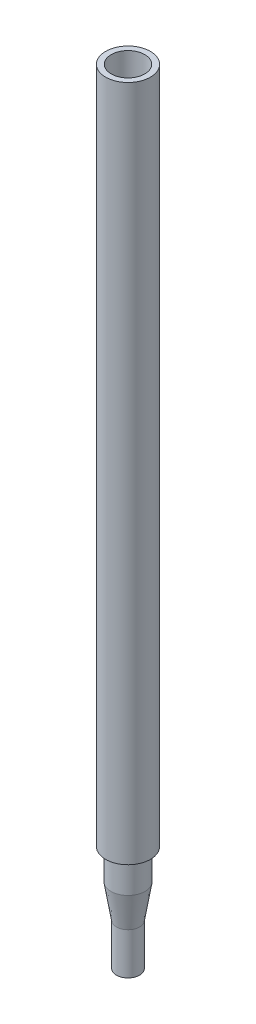
ISO-10303-21;
HEADER;
FILE_DESCRIPTION(('STEP AP214'),'2;1');
FILE_NAME('part.step','',(''),(''),'','','');
FILE_SCHEMA(('AUTOMOTIVE_DESIGN { 1 0 10303 214 1 1 1 1 }'));
ENDSEC;
DATA;
#1=APPLICATION_CONTEXT('core data for automotive mechanical design processes');
#2=APPLICATION_PROTOCOL_DEFINITION('international standard','automotive_design',2000,#1);
#3=PRODUCT_CONTEXT('',#1,'mechanical');
#4=PRODUCT('Part','Part','',(#3));
#5=PRODUCT_RELATED_PRODUCT_CATEGORY('part','',(#4));
#6=PRODUCT_DEFINITION_FORMATION('','',#4);
#7=PRODUCT_DEFINITION_CONTEXT('part definition',#1,'design');
#8=PRODUCT_DEFINITION('design','',#6,#7);
#9=PRODUCT_DEFINITION_SHAPE('','',#8);
#10=(LENGTH_UNIT() NAMED_UNIT(*) SI_UNIT(.MILLI.,.METRE.));
#11=(NAMED_UNIT(*) PLANE_ANGLE_UNIT() SI_UNIT($,.RADIAN.));
#12=(NAMED_UNIT(*) SI_UNIT($,.STERADIAN.) SOLID_ANGLE_UNIT());
#13=UNCERTAINTY_MEASURE_WITH_UNIT(LENGTH_MEASURE(1.E-05),#10,'distance_accuracy_value','');
#14=(GEOMETRIC_REPRESENTATION_CONTEXT(3) GLOBAL_UNCERTAINTY_ASSIGNED_CONTEXT((#13)) GLOBAL_UNIT_ASSIGNED_CONTEXT((#10,
#11,#12)) REPRESENTATION_CONTEXT('',''));
#15=CARTESIAN_POINT('',(0.,0.,0.));
#16=DIRECTION('',(0.,0.,1.));
#17=DIRECTION('',(1.,0.,0.));
#18=AXIS2_PLACEMENT_3D('',#15,#16,#17);
#19=CARTESIAN_POINT('',(0.,0.,1.555));
#20=DIRECTION('',(0.,1.,0.));
#21=DIRECTION('',(0.,0.,1.));
#22=AXIS2_PLACEMENT_3D('',#19,#20,#21);
#23=PLANE('',#22);
#24=CARTESIAN_POINT('',(0.,0.,0.));
#25=DIRECTION('',(0.,-1.,0.));
#26=DIRECTION('',(0.,0.,-1.));
#27=AXIS2_PLACEMENT_3D('',#24,#25,#26);
#28=CIRCLE('',#27,0.805);
#29=CARTESIAN_POINT('',(0.,0.,-0.805000000000003));
#30=VERTEX_POINT('',#29);
#31=EDGE_CURVE('E10',#30,#30,#28,.T.);
#32=ORIENTED_EDGE('',*,*,#31,.F.);
#33=EDGE_LOOP('',(#32));
#34=FACE_BOUND('',#33,.T.);
#35=CARTESIAN_POINT('',(0.,0.,0.));
#36=DIRECTION('',(0.,-1.,0.));
#37=DIRECTION('',(0.,0.,-1.));
#38=AXIS2_PLACEMENT_3D('',#35,#36,#37);
#39=CIRCLE('',#38,1.555);
#40=CARTESIAN_POINT('',(0.,0.,-1.55500000000001));
#41=VERTEX_POINT('',#40);
#42=EDGE_CURVE('E68',#41,#41,#39,.T.);
#43=ORIENTED_EDGE('',*,*,#42,.T.);
#44=EDGE_LOOP('',(#43));
#45=FACE_BOUND('',#44,.T.);
#46=ADVANCED_FACE('F28',(#34,#45),#23,.F.);
#47=CARTESIAN_POINT('',(0.,0.,0.));
#48=DIRECTION('',(0.,-1.,0.));
#49=DIRECTION('',(0.,0.,-1.));
#50=AXIS2_PLACEMENT_3D('',#47,#48,#49);
#51=CYLINDRICAL_SURFACE('',#50,0.805);
#52=CARTESIAN_POINT('',(0.,5.66080881225856,0.));
#53=DIRECTION('',(0.,-1.,0.));
#54=DIRECTION('',(0.,0.,-1.));
#55=AXIS2_PLACEMENT_3D('',#52,#53,#54);
#56=CIRCLE('',#55,0.805);
#57=CARTESIAN_POINT('',(0.,5.66080881225856,-0.805000000000003));
#58=VERTEX_POINT('',#57);
#59=EDGE_CURVE('E34',#58,#58,#56,.T.);
#60=ORIENTED_EDGE('',*,*,#59,.F.);
#61=EDGE_LOOP('',(#60));
#62=FACE_BOUND('',#61,.T.);
#63=ORIENTED_EDGE('',*,*,#31,.T.);
#64=EDGE_LOOP('',(#63));
#65=FACE_BOUND('',#64,.T.);
#66=ADVANCED_FACE('F129',(#62,#65),#51,.F.);
#67=CARTESIAN_POINT('',(0.,5.66080881225856,0.));
#68=DIRECTION('',(0.,1.,0.));
#69=DIRECTION('',(0.,0.,1.));
#70=AXIS2_PLACEMENT_3D('',#67,#68,#69);
#71=CONICAL_SURFACE('',#70,0.805,0.161802903644521);
#72=CARTESIAN_POINT('',(0.,10.1636614601297,0.));
#73=DIRECTION('',(0.,-1.,0.));
#74=DIRECTION('',(0.,0.,-1.));
#75=AXIS2_PLACEMENT_3D('',#72,#73,#74);
#76=CIRCLE('',#75,1.54);
#77=CARTESIAN_POINT('',(0.,10.1636614601297,-1.54000000000001));
#78=VERTEX_POINT('',#77);
#79=EDGE_CURVE('E38',#78,#78,#76,.T.);
#80=ORIENTED_EDGE('',*,*,#79,.F.);
#81=EDGE_LOOP('',(#80));
#82=FACE_BOUND('',#81,.T.);
#83=ORIENTED_EDGE('',*,*,#59,.T.);
#84=EDGE_LOOP('',(#83));
#85=FACE_BOUND('',#84,.T.);
#86=ADVANCED_FACE('F124',(#82,#85),#71,.F.);
#87=CARTESIAN_POINT('',(0.,0.,0.));
#88=DIRECTION('',(0.,-1.,0.));
#89=DIRECTION('',(0.,0.,-1.));
#90=AXIS2_PLACEMENT_3D('',#87,#88,#89);
#91=CYLINDRICAL_SURFACE('',#90,1.54);
#92=CARTESIAN_POINT('',(0.,14.0632779357849,0.));
#93=DIRECTION('',(0.,-1.,0.));
#94=DIRECTION('',(0.,0.,-1.));
#95=AXIS2_PLACEMENT_3D('',#92,#93,#94);
#96=CIRCLE('',#95,1.54);
#97=CARTESIAN_POINT('',(0.,14.0632779357849,-1.54000000000001));
#98=VERTEX_POINT('',#97);
#99=EDGE_CURVE('E42',#98,#98,#96,.T.);
#100=ORIENTED_EDGE('',*,*,#99,.F.);
#101=EDGE_LOOP('',(#100));
#102=FACE_BOUND('',#101,.T.);
#103=ORIENTED_EDGE('',*,*,#79,.T.);
#104=EDGE_LOOP('',(#103));
#105=FACE_BOUND('',#104,.T.);
#106=ADVANCED_FACE('F118',(#102,#105),#91,.F.);
#107=CARTESIAN_POINT('',(0.,14.0632779357849,0.));
#108=DIRECTION('',(0.,1.,0.));
#109=DIRECTION('',(0.,0.,1.));
#110=AXIS2_PLACEMENT_3D('',#107,#108,#109);
#111=CONICAL_SURFACE('',#110,1.54,0.959931088596887);
#112=CARTESIAN_POINT('',(0.,14.5604252879138,0.));
#113=DIRECTION('',(0.,-1.,0.));
#114=DIRECTION('',(0.,0.,-1.));
#115=AXIS2_PLACEMENT_3D('',#112,#113,#114);
#116=CIRCLE('',#115,2.25);
#117=CARTESIAN_POINT('',(0.,14.5604252879138,-2.25000000000001));
#118=VERTEX_POINT('',#117);
#119=EDGE_CURVE('E47',#118,#118,#116,.T.);
#120=ORIENTED_EDGE('',*,*,#119,.F.);
#121=EDGE_LOOP('',(#120));
#122=FACE_BOUND('',#121,.T.);
#123=ORIENTED_EDGE('',*,*,#99,.T.);
#124=EDGE_LOOP('',(#123));
#125=FACE_BOUND('',#124,.T.);
#126=ADVANCED_FACE('F112',(#122,#125),#111,.F.);
#127=CARTESIAN_POINT('',(0.,0.,0.));
#128=DIRECTION('',(0.,-1.,0.));
#129=DIRECTION('',(0.,0.,-1.));
#130=AXIS2_PLACEMENT_3D('',#127,#128,#129);
#131=CYLINDRICAL_SURFACE('',#130,2.25);
#132=CARTESIAN_POINT('',(0.,105.,0.));
#133=DIRECTION('',(0.,-1.,0.));
#134=DIRECTION('',(0.,0.,-1.));
#135=AXIS2_PLACEMENT_3D('',#132,#133,#134);
#136=CIRCLE('',#135,2.25);
#137=CARTESIAN_POINT('',(0.,105.,-2.25000000000001));
#138=VERTEX_POINT('',#137);
#139=EDGE_CURVE('E50',#138,#138,#136,.T.);
#140=ORIENTED_EDGE('',*,*,#139,.F.);
#141=EDGE_LOOP('',(#140));
#142=FACE_BOUND('',#141,.T.);
#143=ORIENTED_EDGE('',*,*,#119,.T.);
#144=EDGE_LOOP('',(#143));
#145=FACE_BOUND('',#144,.T.);
#146=ADVANCED_FACE('F106',(#142,#145),#131,.F.);
#147=CARTESIAN_POINT('',(0.,105.,2.25000000000001));
#148=DIRECTION('',(0.,-1.,0.));
#149=DIRECTION('',(0.,0.,-1.));
#150=AXIS2_PLACEMENT_3D('',#147,#148,#149);
#151=PLANE('',#150);
#152=CARTESIAN_POINT('',(0.,105.,0.));
#153=DIRECTION('',(0.,-1.,0.));
#154=DIRECTION('',(0.,0.,-1.));
#155=AXIS2_PLACEMENT_3D('',#152,#153,#154);
#156=CIRCLE('',#155,3.);
#157=CARTESIAN_POINT('',(0.,105.,-3.00000000000001));
#158=VERTEX_POINT('',#157);
#159=EDGE_CURVE('E53',#158,#158,#156,.T.);
#160=ORIENTED_EDGE('',*,*,#159,.F.);
#161=EDGE_LOOP('',(#160));
#162=FACE_BOUND('',#161,.T.);
#163=ORIENTED_EDGE('',*,*,#139,.T.);
#164=EDGE_LOOP('',(#163));
#165=FACE_BOUND('',#164,.T.);
#166=ADVANCED_FACE('F100',(#162,#165),#151,.F.);
#167=CARTESIAN_POINT('',(0.,0.,0.));
#168=DIRECTION('',(0.,-1.,0.));
#169=DIRECTION('',(0.,0.,-1.));
#170=AXIS2_PLACEMENT_3D('',#167,#168,#169);
#171=CYLINDRICAL_SURFACE('',#170,3.);
#172=CARTESIAN_POINT('',(0.,14.17,0.));
#173=DIRECTION('',(0.,-1.,0.));
#174=DIRECTION('',(0.,0.,-1.));
#175=AXIS2_PLACEMENT_3D('',#172,#173,#174);
#176=CIRCLE('',#175,3.);
#177=CARTESIAN_POINT('',(0.,14.17,-3.00000000000001));
#178=VERTEX_POINT('',#177);
#179=EDGE_CURVE('E56',#178,#178,#176,.T.);
#180=ORIENTED_EDGE('',*,*,#179,.F.);
#181=EDGE_LOOP('',(#180));
#182=FACE_BOUND('',#181,.T.);
#183=ORIENTED_EDGE('',*,*,#159,.T.);
#184=EDGE_LOOP('',(#183));
#185=FACE_BOUND('',#184,.T.);
#186=ADVANCED_FACE('F94',(#182,#185),#171,.T.);
#187=CARTESIAN_POINT('',(0.,14.17,0.));
#188=DIRECTION('',(0.,1.,0.));
#189=DIRECTION('',(0.,0.,1.));
#190=AXIS2_PLACEMENT_3D('',#187,#188,#189);
#191=CONICAL_SURFACE('',#190,3.,0.959931088596887);
#192=CARTESIAN_POINT('',(0.,13.6728526478711,0.));
#193=DIRECTION('',(0.,-1.,0.));
#194=DIRECTION('',(0.,0.,-1.));
#195=AXIS2_PLACEMENT_3D('',#192,#193,#194);
#196=CIRCLE('',#195,2.29);
#197=CARTESIAN_POINT('',(0.,13.6728526478711,-2.29000000000001));
#198=VERTEX_POINT('',#197);
#199=EDGE_CURVE('E59',#198,#198,#196,.T.);
#200=ORIENTED_EDGE('',*,*,#199,.F.);
#201=EDGE_LOOP('',(#200));
#202=FACE_BOUND('',#201,.T.);
#203=ORIENTED_EDGE('',*,*,#179,.T.);
#204=EDGE_LOOP('',(#203));
#205=FACE_BOUND('',#204,.T.);
#206=ADVANCED_FACE('F88',(#202,#205),#191,.T.);
#207=CARTESIAN_POINT('',(0.,0.,0.));
#208=DIRECTION('',(0.,-1.,0.));
#209=DIRECTION('',(0.,0.,-1.));
#210=AXIS2_PLACEMENT_3D('',#207,#208,#209);
#211=CYLINDRICAL_SURFACE('',#210,2.29);
#212=CARTESIAN_POINT('',(0.,10.1028526478711,0.));
#213=DIRECTION('',(0.,-1.,0.));
#214=DIRECTION('',(0.,0.,-1.));
#215=AXIS2_PLACEMENT_3D('',#212,#213,#214);
#216=CIRCLE('',#215,2.29);
#217=CARTESIAN_POINT('',(0.,10.1028526478711,-2.29000000000001));
#218=VERTEX_POINT('',#217);
#219=EDGE_CURVE('E62',#218,#218,#216,.T.);
#220=ORIENTED_EDGE('',*,*,#219,.F.);
#221=EDGE_LOOP('',(#220));
#222=FACE_BOUND('',#221,.T.);
#223=ORIENTED_EDGE('',*,*,#199,.T.);
#224=EDGE_LOOP('',(#223));
#225=FACE_BOUND('',#224,.T.);
#226=ADVANCED_FACE('F82',(#222,#225),#211,.T.);
#227=CARTESIAN_POINT('',(0.,10.1028526478711,0.));
#228=DIRECTION('',(0.,1.,0.));
#229=DIRECTION('',(0.,0.,1.));
#230=AXIS2_PLACEMENT_3D('',#227,#228,#229);
#231=CONICAL_SURFACE('',#230,2.29,0.161802903644521);
#232=CARTESIAN_POINT('',(0.,5.6,0.));
#233=DIRECTION('',(0.,-1.,0.));
#234=DIRECTION('',(0.,0.,-1.));
#235=AXIS2_PLACEMENT_3D('',#232,#233,#234);
#236=CIRCLE('',#235,1.555);
#237=CARTESIAN_POINT('',(0.,5.6,-1.55500000000001));
#238=VERTEX_POINT('',#237);
#239=EDGE_CURVE('E65',#238,#238,#236,.T.);
#240=ORIENTED_EDGE('',*,*,#239,.F.);
#241=EDGE_LOOP('',(#240));
#242=FACE_BOUND('',#241,.T.);
#243=ORIENTED_EDGE('',*,*,#219,.T.);
#244=EDGE_LOOP('',(#243));
#245=FACE_BOUND('',#244,.T.);
#246=ADVANCED_FACE('F76',(#242,#245),#231,.T.);
#247=CARTESIAN_POINT('',(0.,0.,0.));
#248=DIRECTION('',(0.,-1.,0.));
#249=DIRECTION('',(0.,0.,-1.));
#250=AXIS2_PLACEMENT_3D('',#247,#248,#249);
#251=CYLINDRICAL_SURFACE('',#250,1.555);
#252=ORIENTED_EDGE('',*,*,#42,.F.);
#253=EDGE_LOOP('',(#252));
#254=FACE_BOUND('',#253,.T.);
#255=ORIENTED_EDGE('',*,*,#239,.T.);
#256=EDGE_LOOP('',(#255));
#257=FACE_BOUND('',#256,.T.);
#258=ADVANCED_FACE('F73',(#254,#257),#251,.T.);
#259=CLOSED_SHELL('',(#46,#66,#86,#106,#126,#146,#166,#186,#206,#226,#246,#258));
#260=MANIFOLD_SOLID_BREP('B2',#259);
#261=ADVANCED_BREP_SHAPE_REPRESENTATION('',(#18,#260),#14);
#262=SHAPE_DEFINITION_REPRESENTATION(#9,#261);
ENDSEC;
END-ISO-10303-21;
